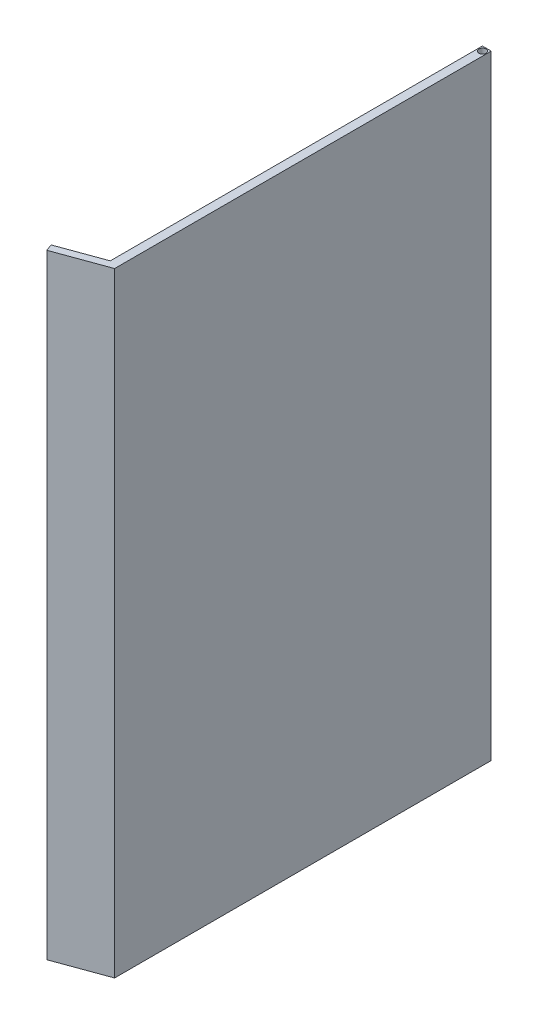
ISO-10303-21;
HEADER;
FILE_DESCRIPTION(('STEP AP214'),'2;1');
FILE_NAME('part.step','',(''),(''),'','','');
FILE_SCHEMA(('AUTOMOTIVE_DESIGN { 1 0 10303 214 1 1 1 1 }'));
ENDSEC;
DATA;
#1=APPLICATION_CONTEXT('core data for automotive mechanical design processes');
#2=APPLICATION_PROTOCOL_DEFINITION('international standard','automotive_design',2000,#1);
#3=PRODUCT_CONTEXT('',#1,'mechanical');
#4=PRODUCT('Part','Part','',(#3));
#5=PRODUCT_RELATED_PRODUCT_CATEGORY('part','',(#4));
#6=PRODUCT_DEFINITION_FORMATION('','',#4);
#7=PRODUCT_DEFINITION_CONTEXT('part definition',#1,'design');
#8=PRODUCT_DEFINITION('design','',#6,#7);
#9=PRODUCT_DEFINITION_SHAPE('','',#8);
#10=(LENGTH_UNIT() NAMED_UNIT(*) SI_UNIT(.MILLI.,.METRE.));
#11=(NAMED_UNIT(*) PLANE_ANGLE_UNIT() SI_UNIT($,.RADIAN.));
#12=(NAMED_UNIT(*) SI_UNIT($,.STERADIAN.) SOLID_ANGLE_UNIT());
#13=UNCERTAINTY_MEASURE_WITH_UNIT(LENGTH_MEASURE(1.E-05),#10,'distance_accuracy_value','');
#14=(GEOMETRIC_REPRESENTATION_CONTEXT(3) GLOBAL_UNCERTAINTY_ASSIGNED_CONTEXT((#13)) GLOBAL_UNIT_ASSIGNED_CONTEXT((#10,
#11,#12)) REPRESENTATION_CONTEXT('',''));
#15=CARTESIAN_POINT('',(0.,0.,0.));
#16=DIRECTION('',(0.,0.,1.));
#17=DIRECTION('',(1.,0.,0.));
#18=AXIS2_PLACEMENT_3D('',#15,#16,#17);
#19=CARTESIAN_POINT('',(1.21931064787366,85.,-16.7659100131921));
#20=DIRECTION('',(0.,0.,1.));
#21=DIRECTION('',(1.,0.,0.));
#22=AXIS2_PLACEMENT_3D('',#19,#20,#21);
#23=PLANE('',#22);
#24=DIRECTION('',(-1.,0.,0.));
#25=VECTOR('',#24,1.);
#26=CARTESIAN_POINT('',(1.21931064787366,0.,-16.7659100131921));
#27=LINE('',#26,#25);
#28=CARTESIAN_POINT('',(1.21931064787366,0.,-16.7659100131921));
#29=VERTEX_POINT('',#28);
#30=CARTESIAN_POINT('',(0.,0.,-16.7659100131921));
#31=VERTEX_POINT('',#30);
#32=EDGE_CURVE('E123',#29,#31,#27,.T.);
#33=ORIENTED_EDGE('',*,*,#32,.T.);
#34=DIRECTION('',(0.,-1.,0.));
#35=VECTOR('',#34,1.);
#36=CARTESIAN_POINT('',(0.,85.,-16.7659100131921));
#37=LINE('',#36,#35);
#38=CARTESIAN_POINT('',(0.,85.,-16.7659100131921));
#39=VERTEX_POINT('',#38);
#40=EDGE_CURVE('E141',#39,#31,#37,.T.);
#41=ORIENTED_EDGE('',*,*,#40,.F.);
#42=DIRECTION('',(-1.,0.,0.));
#43=VECTOR('',#42,1.);
#44=CARTESIAN_POINT('',(1.21931064787366,85.,-16.7659100131921));
#45=LINE('',#44,#43);
#46=CARTESIAN_POINT('',(1.21931064787366,85.,-16.7659100131921));
#47=VERTEX_POINT('',#46);
#48=EDGE_CURVE('E134',#47,#39,#45,.T.);
#49=ORIENTED_EDGE('',*,*,#48,.F.);
#50=DIRECTION('',(0.,-1.,0.));
#51=VECTOR('',#50,1.);
#52=CARTESIAN_POINT('',(1.21931064787366,85.,-16.7659100131921));
#53=LINE('',#52,#51);
#54=EDGE_CURVE('E119',#47,#29,#53,.T.);
#55=ORIENTED_EDGE('',*,*,#54,.T.);
#56=EDGE_LOOP('',(#33,#41,#49,#55));
#57=FACE_BOUND('',#56,.T.);
#58=ADVANCED_FACE('F35',(#57),#23,.F.);
#59=CARTESIAN_POINT('',(0.,85.,-16.7659100131921));
#60=DIRECTION('',(1.,0.,0.));
#61=DIRECTION('',(0.,0.,-1.));
#62=AXIS2_PLACEMENT_3D('',#59,#60,#61);
#63=PLANE('',#62);
#64=DIRECTION('',(0.,0.,1.));
#65=VECTOR('',#64,1.);
#66=CARTESIAN_POINT('',(0.,0.,-16.7659100131921));
#67=LINE('',#66,#65);
#68=CARTESIAN_POINT('',(0.,0.,34.7140899868079));
#69=VERTEX_POINT('',#68);
#70=EDGE_CURVE('E126',#31,#69,#67,.T.);
#71=ORIENTED_EDGE('',*,*,#70,.T.);
#72=DIRECTION('',(0.,-1.,0.));
#73=VECTOR('',#72,1.);
#74=CARTESIAN_POINT('',(0.,85.,34.7140899868079));
#75=LINE('',#74,#73);
#76=CARTESIAN_POINT('',(0.,85.,34.7140899868079));
#77=VERTEX_POINT('',#76);
#78=EDGE_CURVE('E138',#77,#69,#75,.T.);
#79=ORIENTED_EDGE('',*,*,#78,.F.);
#80=DIRECTION('',(0.,0.,1.));
#81=VECTOR('',#80,1.);
#82=CARTESIAN_POINT('',(0.,85.,-16.7659100131921));
#83=LINE('',#82,#81);
#84=EDGE_CURVE('E90',#39,#77,#83,.T.);
#85=ORIENTED_EDGE('',*,*,#84,.F.);
#86=ORIENTED_EDGE('',*,*,#40,.T.);
#87=EDGE_LOOP('',(#71,#79,#85,#86));
#88=FACE_BOUND('',#87,.T.);
#89=ADVANCED_FACE('F171',(#88),#63,.F.);
#90=CARTESIAN_POINT('',(0.,85.,34.7140899868079));
#91=DIRECTION('',(0.342020143325667,0.,0.939692620785909));
#92=DIRECTION('',(0.939692620785909,0.,-0.342020143325667));
#93=AXIS2_PLACEMENT_3D('',#90,#91,#92);
#94=PLANE('',#93);
#95=CARTESIAN_POINT('',(-4.79537646316474,3.79038287197134,36.4594642815006));
#96=DIRECTION('',(0.342020143325667,0.,0.939692620785909));
#97=DIRECTION('',(0.939692620785909,0.,-0.342020143325667));
#98=AXIS2_PLACEMENT_3D('',#95,#96,#97);
#99=CIRCLE('',#98,0.300235792968118);
#100=CARTESIAN_POINT('',(-4.51324710401679,3.79038287197134,36.3567775925581));
#101=VERTEX_POINT('',#100);
#102=EDGE_CURVE('E11',#101,#101,#99,.F.);
#103=ORIENTED_EDGE('',*,*,#102,.F.);
#104=EDGE_LOOP('',(#103));
#105=FACE_BOUND('',#104,.T.);
#106=CARTESIAN_POINT('',(-4.79537646316474,13.7903828719713,36.4594642815006));
#107=DIRECTION('',(0.342020143325667,0.,0.939692620785909));
#108=DIRECTION('',(0.939692620785909,0.,-0.342020143325667));
#109=AXIS2_PLACEMENT_3D('',#106,#107,#108);
#110=CIRCLE('',#109,0.300235792968118);
#111=CARTESIAN_POINT('',(-4.51324710401679,13.7903828719713,36.3567775925581));
#112=VERTEX_POINT('',#111);
#113=EDGE_CURVE('E43',#112,#112,#110,.F.);
#114=ORIENTED_EDGE('',*,*,#113,.F.);
#115=EDGE_LOOP('',(#114));
#116=FACE_BOUND('',#115,.T.);
#117=CARTESIAN_POINT('',(-4.79537646316474,23.7903828719713,36.4594642815006));
#118=DIRECTION('',(0.342020143325667,0.,0.939692620785909));
#119=DIRECTION('',(0.939692620785909,0.,-0.342020143325667));
#120=AXIS2_PLACEMENT_3D('',#117,#118,#119);
#121=CIRCLE('',#120,0.300235792968118);
#122=CARTESIAN_POINT('',(-4.51324710401679,23.7903828719713,36.3567775925581));
#123=VERTEX_POINT('',#122);
#124=EDGE_CURVE('E161',#123,#123,#121,.F.);
#125=ORIENTED_EDGE('',*,*,#124,.F.);
#126=EDGE_LOOP('',(#125));
#127=FACE_BOUND('',#126,.T.);
#128=CARTESIAN_POINT('',(-4.79537646316474,33.7903828719713,36.4594642815006));
#129=DIRECTION('',(0.342020143325667,0.,0.939692620785909));
#130=DIRECTION('',(0.939692620785909,0.,-0.342020143325667));
#131=AXIS2_PLACEMENT_3D('',#128,#129,#130);
#132=CIRCLE('',#131,0.300235792968118);
#133=CARTESIAN_POINT('',(-4.51324710401679,33.7903828719713,36.3567775925581));
#134=VERTEX_POINT('',#133);
#135=EDGE_CURVE('E158',#134,#134,#132,.F.);
#136=ORIENTED_EDGE('',*,*,#135,.F.);
#137=EDGE_LOOP('',(#136));
#138=FACE_BOUND('',#137,.T.);
#139=CARTESIAN_POINT('',(-4.79537646316474,43.7903828719713,36.4594642815006));
#140=DIRECTION('',(0.342020143325667,0.,0.939692620785909));
#141=DIRECTION('',(0.939692620785909,0.,-0.342020143325667));
#142=AXIS2_PLACEMENT_3D('',#139,#140,#141);
#143=CIRCLE('',#142,0.300235792968118);
#144=CARTESIAN_POINT('',(-4.51324710401679,43.7903828719713,36.3567775925581));
#145=VERTEX_POINT('',#144);
#146=EDGE_CURVE('E155',#145,#145,#143,.F.);
#147=ORIENTED_EDGE('',*,*,#146,.F.);
#148=EDGE_LOOP('',(#147));
#149=FACE_BOUND('',#148,.T.);
#150=CARTESIAN_POINT('',(-4.79537646316474,53.7903828719713,36.4594642815006));
#151=DIRECTION('',(0.342020143325667,0.,0.939692620785909));
#152=DIRECTION('',(0.939692620785909,0.,-0.342020143325667));
#153=AXIS2_PLACEMENT_3D('',#150,#151,#152);
#154=CIRCLE('',#153,0.300235792968118);
#155=CARTESIAN_POINT('',(-4.51324710401679,53.7903828719713,36.3567775925581));
#156=VERTEX_POINT('',#155);
#157=EDGE_CURVE('E152',#156,#156,#154,.F.);
#158=ORIENTED_EDGE('',*,*,#157,.F.);
#159=EDGE_LOOP('',(#158));
#160=FACE_BOUND('',#159,.T.);
#161=CARTESIAN_POINT('',(-4.79537646316474,63.7903828719713,36.4594642815006));
#162=DIRECTION('',(0.342020143325667,0.,0.939692620785909));
#163=DIRECTION('',(0.939692620785909,0.,-0.342020143325667));
#164=AXIS2_PLACEMENT_3D('',#161,#162,#163);
#165=CIRCLE('',#164,0.300235792968118);
#166=CARTESIAN_POINT('',(-4.51324710401679,63.7903828719713,36.3567775925581));
#167=VERTEX_POINT('',#166);
#168=EDGE_CURVE('E149',#167,#167,#165,.F.);
#169=ORIENTED_EDGE('',*,*,#168,.F.);
#170=EDGE_LOOP('',(#169));
#171=FACE_BOUND('',#170,.T.);
#172=CARTESIAN_POINT('',(-4.79537646316474,73.7903828719713,36.4594642815006));
#173=DIRECTION('',(0.342020143325667,0.,0.939692620785909));
#174=DIRECTION('',(0.939692620785909,0.,-0.342020143325667));
#175=AXIS2_PLACEMENT_3D('',#172,#173,#174);
#176=CIRCLE('',#175,0.300235792968118);
#177=CARTESIAN_POINT('',(-4.51324710401679,73.7903828719713,36.3567775925581));
#178=VERTEX_POINT('',#177);
#179=EDGE_CURVE('E146',#178,#178,#176,.F.);
#180=ORIENTED_EDGE('',*,*,#179,.F.);
#181=EDGE_LOOP('',(#180));
#182=FACE_BOUND('',#181,.T.);
#183=CARTESIAN_POINT('',(-4.79537646316474,83.7903828719713,36.4594642815006));
#184=DIRECTION('',(0.342020143325667,0.,0.939692620785909));
#185=DIRECTION('',(0.939692620785909,0.,-0.342020143325667));
#186=AXIS2_PLACEMENT_3D('',#183,#184,#185);
#187=CIRCLE('',#186,0.300235792968118);
#188=CARTESIAN_POINT('',(-4.51324710401679,83.7903828719713,36.3567775925581));
#189=VERTEX_POINT('',#188);
#190=EDGE_CURVE('E143',#189,#189,#187,.F.);
#191=ORIENTED_EDGE('',*,*,#190,.F.);
#192=EDGE_LOOP('',(#191));
#193=FACE_BOUND('',#192,.T.);
#194=DIRECTION('',(-0.939692620785909,0.,0.342020143325667));
#195=VECTOR('',#194,1.);
#196=CARTESIAN_POINT('',(0.,0.,34.7140899868079));
#197=LINE('',#196,#195);
#198=CARTESIAN_POINT('',(-5.99999999999999,0.,36.8979113924051));
#199=VERTEX_POINT('',#198);
#200=EDGE_CURVE('E129',#69,#199,#197,.T.);
#201=ORIENTED_EDGE('',*,*,#200,.T.);
#202=DIRECTION('',(0.,-1.,0.));
#203=VECTOR('',#202,1.);
#204=CARTESIAN_POINT('',(-5.99999999999999,85.,36.8979113924051));
#205=LINE('',#204,#203);
#206=CARTESIAN_POINT('',(-5.99999999999999,85.,36.8979113924051));
#207=VERTEX_POINT('',#206);
#208=EDGE_CURVE('E114',#207,#199,#205,.T.);
#209=ORIENTED_EDGE('',*,*,#208,.F.);
#210=DIRECTION('',(-0.939692620785909,0.,0.342020143325667));
#211=VECTOR('',#210,1.);
#212=CARTESIAN_POINT('',(0.,85.,34.7140899868079));
#213=LINE('',#212,#211);
#214=EDGE_CURVE('E105',#77,#207,#213,.T.);
#215=ORIENTED_EDGE('',*,*,#214,.F.);
#216=ORIENTED_EDGE('',*,*,#78,.T.);
#217=EDGE_LOOP('',(#201,#209,#215,#216));
#218=FACE_BOUND('',#217,.T.);
#219=ADVANCED_FACE('F168',(#105,#116,#127,#138,#149,#160,#171,#182,#193,#218),#94,.F.);
#220=CARTESIAN_POINT('',(-5.99999999999999,85.,36.8979113924051));
#221=DIRECTION('',(0.939692620785911,0.,-0.342020143325661));
#222=DIRECTION('',(-0.342020143325661,0.,-0.939692620785911));
#223=AXIS2_PLACEMENT_3D('',#220,#221,#222);
#224=PLANE('',#223);
#225=DIRECTION('',(0.342020143325661,0.,0.939692620785911));
#226=VECTOR('',#225,1.);
#227=CARTESIAN_POINT('',(-5.99999999999999,0.,36.8979113924051));
#228=LINE('',#227,#226);
#229=CARTESIAN_POINT('',(-5.65797985667433,0.,37.837604013191));
#230=VERTEX_POINT('',#229);
#231=EDGE_CURVE('E113',#199,#230,#228,.T.);
#232=ORIENTED_EDGE('',*,*,#231,.T.);
#233=DIRECTION('',(0.,-1.,0.));
#234=VECTOR('',#233,1.);
#235=CARTESIAN_POINT('',(-5.65797985667433,85.,37.837604013191));
#236=LINE('',#235,#234);
#237=CARTESIAN_POINT('',(-5.65797985667433,85.,37.837604013191));
#238=VERTEX_POINT('',#237);
#239=EDGE_CURVE('E110',#238,#230,#236,.T.);
#240=ORIENTED_EDGE('',*,*,#239,.F.);
#241=DIRECTION('',(0.342020143325661,0.,0.939692620785911));
#242=VECTOR('',#241,1.);
#243=CARTESIAN_POINT('',(-5.99999999999999,85.,36.8979113924051));
#244=LINE('',#243,#242);
#245=EDGE_CURVE('E99',#207,#238,#244,.T.);
#246=ORIENTED_EDGE('',*,*,#245,.F.);
#247=ORIENTED_EDGE('',*,*,#208,.T.);
#248=EDGE_LOOP('',(#232,#240,#246,#247));
#249=FACE_BOUND('',#248,.T.);
#250=ADVANCED_FACE('F111',(#249),#224,.F.);
#251=CARTESIAN_POINT('',(-5.65797985667433,85.,37.837604013191));
#252=DIRECTION('',(-0.342020143325666,0.,-0.939692620785909));
#253=DIRECTION('',(-0.939692620785909,0.,0.342020143325666));
#254=AXIS2_PLACEMENT_3D('',#251,#252,#253);
#255=PLANE('',#254);
#256=DIRECTION('',(0.939692620785909,0.,-0.342020143325666));
#257=VECTOR('',#256,1.);
#258=CARTESIAN_POINT('',(-5.65797985667433,0.,37.837604013191));
#259=LINE('',#258,#257);
#260=CARTESIAN_POINT('',(1.21931064787366,0.,35.3344749771339));
#261=VERTEX_POINT('',#260);
#262=EDGE_CURVE('E75',#230,#261,#259,.T.);
#263=ORIENTED_EDGE('',*,*,#262,.T.);
#264=DIRECTION('',(0.,-1.,0.));
#265=VECTOR('',#264,1.);
#266=CARTESIAN_POINT('',(1.21931064787366,85.,35.3344749771339));
#267=LINE('',#266,#265);
#268=CARTESIAN_POINT('',(1.21931064787366,85.,35.3344749771339));
#269=VERTEX_POINT('',#268);
#270=EDGE_CURVE('E115',#269,#261,#267,.T.);
#271=ORIENTED_EDGE('',*,*,#270,.F.);
#272=DIRECTION('',(0.939692620785909,0.,-0.342020143325666));
#273=VECTOR('',#272,1.);
#274=CARTESIAN_POINT('',(-5.65797985667433,85.,37.837604013191));
#275=LINE('',#274,#273);
#276=EDGE_CURVE('E103',#238,#269,#275,.T.);
#277=ORIENTED_EDGE('',*,*,#276,.F.);
#278=ORIENTED_EDGE('',*,*,#239,.T.);
#279=EDGE_LOOP('',(#263,#271,#277,#278));
#280=FACE_BOUND('',#279,.T.);
#281=ADVANCED_FACE('F117',(#280),#255,.F.);
#282=CARTESIAN_POINT('',(1.21931064787366,85.,35.3344749771339));
#283=DIRECTION('',(-1.,0.,0.));
#284=DIRECTION('',(0.,0.,1.));
#285=AXIS2_PLACEMENT_3D('',#282,#283,#284);
#286=PLANE('',#285);
#287=DIRECTION('',(0.,0.,-1.));
#288=VECTOR('',#287,1.);
#289=CARTESIAN_POINT('',(1.21931064787366,0.,35.3344749771339));
#290=LINE('',#289,#288);
#291=EDGE_CURVE('E81',#261,#29,#290,.T.);
#292=ORIENTED_EDGE('',*,*,#291,.T.);
#293=ORIENTED_EDGE('',*,*,#54,.F.);
#294=DIRECTION('',(0.,0.,-1.));
#295=VECTOR('',#294,1.);
#296=CARTESIAN_POINT('',(1.21931064787366,85.,35.3344749771339));
#297=LINE('',#296,#295);
#298=EDGE_CURVE('E51',#269,#47,#297,.T.);
#299=ORIENTED_EDGE('',*,*,#298,.F.);
#300=ORIENTED_EDGE('',*,*,#270,.T.);
#301=EDGE_LOOP('',(#292,#293,#299,#300));
#302=FACE_BOUND('',#301,.T.);
#303=ADVANCED_FACE('F195',(#302),#286,.F.);
#304=CARTESIAN_POINT('',(0.,85.,0.));
#305=DIRECTION('',(0.,1.,0.));
#306=DIRECTION('',(0.,0.,1.));
#307=AXIS2_PLACEMENT_3D('',#304,#305,#306);
#308=PLANE('',#307);
#309=CARTESIAN_POINT('',(0.617040076036639,85.,-16.1614848536612));
#310=DIRECTION('',(0.,1.,0.));
#311=DIRECTION('',(0.,0.,1.));
#312=AXIS2_PLACEMENT_3D('',#309,#310,#311);
#313=CIRCLE('',#312,0.501484150633012);
#314=CARTESIAN_POINT('',(0.617040076036639,85.,-15.6600007030282));
#315=VERTEX_POINT('',#314);
#316=EDGE_CURVE('E468',#315,#315,#313,.T.);
#317=ORIENTED_EDGE('',*,*,#316,.F.);
#318=EDGE_LOOP('',(#317));
#319=FACE_BOUND('',#318,.T.);
#320=ORIENTED_EDGE('',*,*,#48,.T.);
#321=ORIENTED_EDGE('',*,*,#84,.T.);
#322=ORIENTED_EDGE('',*,*,#214,.T.);
#323=ORIENTED_EDGE('',*,*,#245,.T.);
#324=ORIENTED_EDGE('',*,*,#276,.T.);
#325=ORIENTED_EDGE('',*,*,#298,.T.);
#326=EDGE_LOOP('',(#320,#321,#322,#323,#324,#325));
#327=FACE_BOUND('',#326,.T.);
#328=ADVANCED_FACE('F101',(#319,#327),#308,.T.);
#329=CARTESIAN_POINT('',(0.,0.,0.));
#330=DIRECTION('',(0.,1.,0.));
#331=DIRECTION('',(0.,0.,1.));
#332=AXIS2_PLACEMENT_3D('',#329,#330,#331);
#333=PLANE('',#332);
#334=CARTESIAN_POINT('',(0.617040076036639,0.,-16.1614848536612));
#335=DIRECTION('',(0.,1.,0.));
#336=DIRECTION('',(0.,0.,1.));
#337=AXIS2_PLACEMENT_3D('',#334,#335,#336);
#338=CIRCLE('',#337,0.501484150633012);
#339=CARTESIAN_POINT('',(0.617040076036639,0.,-15.6600007030282));
#340=VERTEX_POINT('',#339);
#341=EDGE_CURVE('E127',#340,#340,#338,.T.);
#342=ORIENTED_EDGE('',*,*,#341,.T.);
#343=EDGE_LOOP('',(#342));
#344=FACE_BOUND('',#343,.T.);
#345=ORIENTED_EDGE('',*,*,#32,.F.);
#346=ORIENTED_EDGE('',*,*,#291,.F.);
#347=ORIENTED_EDGE('',*,*,#262,.F.);
#348=ORIENTED_EDGE('',*,*,#231,.F.);
#349=ORIENTED_EDGE('',*,*,#200,.F.);
#350=ORIENTED_EDGE('',*,*,#70,.F.);
#351=EDGE_LOOP('',(#345,#346,#347,#348,#349,#350));
#352=FACE_BOUND('',#351,.T.);
#353=ADVANCED_FACE('F191',(#344,#352),#333,.F.);
#354=CARTESIAN_POINT('',(0.617040076036639,0.,-16.1614848536612));
#355=DIRECTION('',(0.,1.,0.));
#356=DIRECTION('',(0.,0.,1.));
#357=AXIS2_PLACEMENT_3D('',#354,#355,#356);
#358=CYLINDRICAL_SURFACE('',#357,0.501484150633012);
#359=ORIENTED_EDGE('',*,*,#341,.F.);
#360=EDGE_LOOP('',(#359));
#361=FACE_BOUND('',#360,.T.);
#362=ORIENTED_EDGE('',*,*,#316,.T.);
#363=EDGE_LOOP('',(#362));
#364=FACE_BOUND('',#363,.T.);
#365=ADVANCED_FACE('F241',(#361,#364),#358,.F.);
#366=CARTESIAN_POINT('',(-4.96638653482757,83.7903828719713,35.9896179711076));
#367=DIRECTION('',(0.342020143325667,0.,0.939692620785909));
#368=DIRECTION('',(0.939692620785909,0.,-0.342020143325667));
#369=AXIS2_PLACEMENT_3D('',#366,#367,#368);
#370=CYLINDRICAL_SURFACE('',#369,0.300235792968118);
#371=CARTESIAN_POINT('',(-4.96638653482757,83.7903828719713,35.9896179711076));
#372=DIRECTION('',(-0.342020143325667,0.,-0.939692620785909));
#373=DIRECTION('',(-0.939692620785909,0.,0.342020143325667));
#374=AXIS2_PLACEMENT_3D('',#371,#372,#373);
#375=CIRCLE('',#374,0.300235792968118);
#376=CARTESIAN_POINT('',(-5.24851589397552,83.7903828719713,36.0923046600501));
#377=VERTEX_POINT('',#376);
#378=EDGE_CURVE('E465',#377,#377,#375,.T.);
#379=ORIENTED_EDGE('',*,*,#378,.F.);
#380=EDGE_LOOP('',(#379));
#381=FACE_BOUND('',#380,.T.);
#382=ORIENTED_EDGE('',*,*,#190,.T.);
#383=EDGE_LOOP('',(#382));
#384=FACE_BOUND('',#383,.T.);
#385=ADVANCED_FACE('F250',(#381,#384),#370,.T.);
#386=CARTESIAN_POINT('',(-4.96638653482757,83.7903828719713,35.9896179711076));
#387=DIRECTION('',(0.342020143325668,0.,0.939692620785909));
#388=DIRECTION('',(0.939692620785909,0.,-0.342020143325668));
#389=AXIS2_PLACEMENT_3D('',#386,#387,#388);
#390=CONICAL_SURFACE('',#389,0.300235792968121,0.489837368305722);
#391=CARTESIAN_POINT('',(-5.15897971295902,83.7903828719713,35.4604725630505));
#392=VERTEX_POINT('',#391);
#393=VERTEX_LOOP('',#392);
#394=FACE_BOUND('',#393,.T.);
#395=ORIENTED_EDGE('',*,*,#378,.T.);
#396=EDGE_LOOP('',(#395));
#397=FACE_BOUND('',#396,.T.);
#398=ADVANCED_FACE('F260',(#394,#397),#390,.T.);
#399=CARTESIAN_POINT('',(-4.96638653482757,73.7903828719713,35.9896179711076));
#400=DIRECTION('',(0.342020143325667,0.,0.939692620785909));
#401=DIRECTION('',(0.939692620785909,0.,-0.342020143325667));
#402=AXIS2_PLACEMENT_3D('',#399,#400,#401);
#403=CYLINDRICAL_SURFACE('',#402,0.300235792968118);
#404=CARTESIAN_POINT('',(-4.96638653482757,73.7903828719713,35.9896179711076));
#405=DIRECTION('',(-0.342020143325667,0.,-0.939692620785909));
#406=DIRECTION('',(-0.939692620785909,0.,0.342020143325667));
#407=AXIS2_PLACEMENT_3D('',#404,#405,#406);
#408=CIRCLE('',#407,0.300235792968118);
#409=CARTESIAN_POINT('',(-5.24851589397552,73.7903828719713,36.0923046600501));
#410=VERTEX_POINT('',#409);
#411=EDGE_CURVE('E462',#410,#410,#408,.T.);
#412=ORIENTED_EDGE('',*,*,#411,.F.);
#413=EDGE_LOOP('',(#412));
#414=FACE_BOUND('',#413,.T.);
#415=ORIENTED_EDGE('',*,*,#179,.T.);
#416=EDGE_LOOP('',(#415));
#417=FACE_BOUND('',#416,.T.);
#418=ADVANCED_FACE('F269',(#414,#417),#403,.T.);
#419=CARTESIAN_POINT('',(-4.96638653482757,63.7903828719713,35.9896179711076));
#420=DIRECTION('',(0.342020143325667,0.,0.939692620785909));
#421=DIRECTION('',(0.939692620785909,0.,-0.342020143325667));
#422=AXIS2_PLACEMENT_3D('',#419,#420,#421);
#423=CYLINDRICAL_SURFACE('',#422,0.300235792968118);
#424=CARTESIAN_POINT('',(-4.96638653482757,63.7903828719713,35.9896179711076));
#425=DIRECTION('',(-0.342020143325667,0.,-0.939692620785909));
#426=DIRECTION('',(-0.939692620785909,0.,0.342020143325667));
#427=AXIS2_PLACEMENT_3D('',#424,#425,#426);
#428=CIRCLE('',#427,0.300235792968118);
#429=CARTESIAN_POINT('',(-5.24851589397552,63.7903828719713,36.0923046600501));
#430=VERTEX_POINT('',#429);
#431=EDGE_CURVE('E459',#430,#430,#428,.T.);
#432=ORIENTED_EDGE('',*,*,#431,.F.);
#433=EDGE_LOOP('',(#432));
#434=FACE_BOUND('',#433,.T.);
#435=ORIENTED_EDGE('',*,*,#168,.T.);
#436=EDGE_LOOP('',(#435));
#437=FACE_BOUND('',#436,.T.);
#438=ADVANCED_FACE('F283',(#434,#437),#423,.T.);
#439=CARTESIAN_POINT('',(-4.96638653482757,53.7903828719713,35.9896179711076));
#440=DIRECTION('',(0.342020143325667,0.,0.939692620785909));
#441=DIRECTION('',(0.939692620785909,0.,-0.342020143325667));
#442=AXIS2_PLACEMENT_3D('',#439,#440,#441);
#443=CYLINDRICAL_SURFACE('',#442,0.300235792968118);
#444=CARTESIAN_POINT('',(-4.96638653482757,53.7903828719713,35.9896179711076));
#445=DIRECTION('',(-0.342020143325667,0.,-0.939692620785909));
#446=DIRECTION('',(-0.939692620785909,0.,0.342020143325667));
#447=AXIS2_PLACEMENT_3D('',#444,#445,#446);
#448=CIRCLE('',#447,0.300235792968118);
#449=CARTESIAN_POINT('',(-5.24851589397552,53.7903828719713,36.0923046600501));
#450=VERTEX_POINT('',#449);
#451=EDGE_CURVE('E456',#450,#450,#448,.T.);
#452=ORIENTED_EDGE('',*,*,#451,.F.);
#453=EDGE_LOOP('',(#452));
#454=FACE_BOUND('',#453,.T.);
#455=ORIENTED_EDGE('',*,*,#157,.T.);
#456=EDGE_LOOP('',(#455));
#457=FACE_BOUND('',#456,.T.);
#458=ADVANCED_FACE('F293',(#454,#457),#443,.T.);
#459=CARTESIAN_POINT('',(-4.96638653482757,43.7903828719713,35.9896179711076));
#460=DIRECTION('',(0.342020143325667,0.,0.939692620785909));
#461=DIRECTION('',(0.939692620785909,0.,-0.342020143325667));
#462=AXIS2_PLACEMENT_3D('',#459,#460,#461);
#463=CYLINDRICAL_SURFACE('',#462,0.300235792968118);
#464=CARTESIAN_POINT('',(-4.96638653482757,43.7903828719713,35.9896179711076));
#465=DIRECTION('',(-0.342020143325667,0.,-0.939692620785909));
#466=DIRECTION('',(-0.939692620785909,0.,0.342020143325667));
#467=AXIS2_PLACEMENT_3D('',#464,#465,#466);
#468=CIRCLE('',#467,0.300235792968118);
#469=CARTESIAN_POINT('',(-5.24851589397552,43.7903828719713,36.0923046600501));
#470=VERTEX_POINT('',#469);
#471=EDGE_CURVE('E453',#470,#470,#468,.T.);
#472=ORIENTED_EDGE('',*,*,#471,.F.);
#473=EDGE_LOOP('',(#472));
#474=FACE_BOUND('',#473,.T.);
#475=ORIENTED_EDGE('',*,*,#146,.T.);
#476=EDGE_LOOP('',(#475));
#477=FACE_BOUND('',#476,.T.);
#478=ADVANCED_FACE('F303',(#474,#477),#463,.T.);
#479=CARTESIAN_POINT('',(-4.96638653482757,33.7903828719713,35.9896179711076));
#480=DIRECTION('',(0.342020143325667,0.,0.939692620785909));
#481=DIRECTION('',(0.939692620785909,0.,-0.342020143325667));
#482=AXIS2_PLACEMENT_3D('',#479,#480,#481);
#483=CYLINDRICAL_SURFACE('',#482,0.300235792968118);
#484=CARTESIAN_POINT('',(-4.96638653482757,33.7903828719713,35.9896179711076));
#485=DIRECTION('',(-0.342020143325667,0.,-0.939692620785909));
#486=DIRECTION('',(-0.939692620785909,0.,0.342020143325667));
#487=AXIS2_PLACEMENT_3D('',#484,#485,#486);
#488=CIRCLE('',#487,0.300235792968118);
#489=CARTESIAN_POINT('',(-5.24851589397552,33.7903828719713,36.0923046600501));
#490=VERTEX_POINT('',#489);
#491=EDGE_CURVE('E450',#490,#490,#488,.T.);
#492=ORIENTED_EDGE('',*,*,#491,.F.);
#493=EDGE_LOOP('',(#492));
#494=FACE_BOUND('',#493,.T.);
#495=ORIENTED_EDGE('',*,*,#135,.T.);
#496=EDGE_LOOP('',(#495));
#497=FACE_BOUND('',#496,.T.);
#498=ADVANCED_FACE('F313',(#494,#497),#483,.T.);
#499=CARTESIAN_POINT('',(-4.96638653482757,23.7903828719713,35.9896179711076));
#500=DIRECTION('',(0.342020143325667,0.,0.939692620785909));
#501=DIRECTION('',(0.939692620785909,0.,-0.342020143325667));
#502=AXIS2_PLACEMENT_3D('',#499,#500,#501);
#503=CYLINDRICAL_SURFACE('',#502,0.300235792968118);
#504=CARTESIAN_POINT('',(-4.96638653482757,23.7903828719713,35.9896179711076));
#505=DIRECTION('',(-0.342020143325667,0.,-0.939692620785909));
#506=DIRECTION('',(-0.939692620785909,0.,0.342020143325667));
#507=AXIS2_PLACEMENT_3D('',#504,#505,#506);
#508=CIRCLE('',#507,0.300235792968118);
#509=CARTESIAN_POINT('',(-5.24851589397552,23.7903828719713,36.0923046600501));
#510=VERTEX_POINT('',#509);
#511=EDGE_CURVE('E445',#510,#510,#508,.T.);
#512=ORIENTED_EDGE('',*,*,#511,.F.);
#513=EDGE_LOOP('',(#512));
#514=FACE_BOUND('',#513,.T.);
#515=ORIENTED_EDGE('',*,*,#124,.T.);
#516=EDGE_LOOP('',(#515));
#517=FACE_BOUND('',#516,.T.);
#518=ADVANCED_FACE('F323',(#514,#517),#503,.T.);
#519=CARTESIAN_POINT('',(-4.96638653482757,13.7903828719713,35.9896179711076));
#520=DIRECTION('',(0.342020143325667,0.,0.939692620785909));
#521=DIRECTION('',(0.939692620785909,0.,-0.342020143325667));
#522=AXIS2_PLACEMENT_3D('',#519,#520,#521);
#523=CYLINDRICAL_SURFACE('',#522,0.300235792968118);
#524=CARTESIAN_POINT('',(-4.96638653482757,13.7903828719713,35.9896179711076));
#525=DIRECTION('',(-0.342020143325667,0.,-0.939692620785909));
#526=DIRECTION('',(-0.939692620785909,0.,0.342020143325667));
#527=AXIS2_PLACEMENT_3D('',#524,#525,#526);
#528=CIRCLE('',#527,0.300235792968118);
#529=CARTESIAN_POINT('',(-5.24851589397552,13.7903828719713,36.0923046600501));
#530=VERTEX_POINT('',#529);
#531=EDGE_CURVE('E442',#530,#530,#528,.T.);
#532=ORIENTED_EDGE('',*,*,#531,.F.);
#533=EDGE_LOOP('',(#532));
#534=FACE_BOUND('',#533,.T.);
#535=ORIENTED_EDGE('',*,*,#113,.T.);
#536=EDGE_LOOP('',(#535));
#537=FACE_BOUND('',#536,.T.);
#538=ADVANCED_FACE('F166',(#534,#537),#523,.T.);
#539=CARTESIAN_POINT('',(-4.96638653482757,3.79038287197134,35.9896179711076));
#540=DIRECTION('',(0.342020143325667,0.,0.939692620785909));
#541=DIRECTION('',(0.939692620785909,0.,-0.342020143325667));
#542=AXIS2_PLACEMENT_3D('',#539,#540,#541);
#543=CYLINDRICAL_SURFACE('',#542,0.300235792968118);
#544=CARTESIAN_POINT('',(-4.96638653482757,3.79038287197134,35.9896179711076));
#545=DIRECTION('',(-0.342020143325667,0.,-0.939692620785909));
#546=DIRECTION('',(-0.939692620785909,0.,0.342020143325667));
#547=AXIS2_PLACEMENT_3D('',#544,#545,#546);
#548=CIRCLE('',#547,0.300235792968118);
#549=CARTESIAN_POINT('',(-5.24851589397552,3.79038287197134,36.0923046600501));
#550=VERTEX_POINT('',#549);
#551=EDGE_CURVE('E441',#550,#550,#548,.T.);
#552=ORIENTED_EDGE('',*,*,#551,.F.);
#553=EDGE_LOOP('',(#552));
#554=FACE_BOUND('',#553,.T.);
#555=ORIENTED_EDGE('',*,*,#102,.T.);
#556=EDGE_LOOP('',(#555));
#557=FACE_BOUND('',#556,.T.);
#558=ADVANCED_FACE('F342',(#554,#557),#543,.T.);
#559=CARTESIAN_POINT('',(-4.96638653482757,73.7903828719713,35.9896179711076));
#560=DIRECTION('',(0.342020143325668,0.,0.939692620785909));
#561=DIRECTION('',(0.939692620785909,0.,-0.342020143325668));
#562=AXIS2_PLACEMENT_3D('',#559,#560,#561);
#563=CONICAL_SURFACE('',#562,0.300235792968121,0.489837368305722);
#564=CARTESIAN_POINT('',(-5.15897971295902,73.7903828719713,35.4604725630505));
#565=VERTEX_POINT('',#564);
#566=VERTEX_LOOP('',#565);
#567=FACE_BOUND('',#566,.T.);
#568=ORIENTED_EDGE('',*,*,#411,.T.);
#569=EDGE_LOOP('',(#568));
#570=FACE_BOUND('',#569,.T.);
#571=ADVANCED_FACE('F352',(#567,#570),#563,.T.);
#572=CARTESIAN_POINT('',(-4.96638653482757,63.7903828719713,35.9896179711076));
#573=DIRECTION('',(0.342020143325668,0.,0.939692620785909));
#574=DIRECTION('',(0.939692620785909,0.,-0.342020143325668));
#575=AXIS2_PLACEMENT_3D('',#572,#573,#574);
#576=CONICAL_SURFACE('',#575,0.300235792968121,0.489837368305722);
#577=CARTESIAN_POINT('',(-5.15897971295902,63.7903828719713,35.4604725630505));
#578=VERTEX_POINT('',#577);
#579=VERTEX_LOOP('',#578);
#580=FACE_BOUND('',#579,.T.);
#581=ORIENTED_EDGE('',*,*,#431,.T.);
#582=EDGE_LOOP('',(#581));
#583=FACE_BOUND('',#582,.T.);
#584=ADVANCED_FACE('F362',(#580,#583),#576,.T.);
#585=CARTESIAN_POINT('',(-4.96638653482757,53.7903828719713,35.9896179711076));
#586=DIRECTION('',(0.342020143325668,0.,0.939692620785909));
#587=DIRECTION('',(0.939692620785909,0.,-0.342020143325668));
#588=AXIS2_PLACEMENT_3D('',#585,#586,#587);
#589=CONICAL_SURFACE('',#588,0.300235792968121,0.489837368305722);
#590=CARTESIAN_POINT('',(-5.15897971295902,53.7903828719713,35.4604725630505));
#591=VERTEX_POINT('',#590);
#592=VERTEX_LOOP('',#591);
#593=FACE_BOUND('',#592,.T.);
#594=ORIENTED_EDGE('',*,*,#451,.T.);
#595=EDGE_LOOP('',(#594));
#596=FACE_BOUND('',#595,.T.);
#597=ADVANCED_FACE('F372',(#593,#596),#589,.T.);
#598=CARTESIAN_POINT('',(-4.96638653482757,43.7903828719713,35.9896179711076));
#599=DIRECTION('',(0.342020143325668,0.,0.939692620785909));
#600=DIRECTION('',(0.939692620785909,0.,-0.342020143325668));
#601=AXIS2_PLACEMENT_3D('',#598,#599,#600);
#602=CONICAL_SURFACE('',#601,0.300235792968121,0.489837368305722);
#603=CARTESIAN_POINT('',(-5.15897971295902,43.7903828719713,35.4604725630505));
#604=VERTEX_POINT('',#603);
#605=VERTEX_LOOP('',#604);
#606=FACE_BOUND('',#605,.T.);
#607=ORIENTED_EDGE('',*,*,#471,.T.);
#608=EDGE_LOOP('',(#607));
#609=FACE_BOUND('',#608,.T.);
#610=ADVANCED_FACE('F382',(#606,#609),#602,.T.);
#611=CARTESIAN_POINT('',(-4.96638653482757,33.7903828719713,35.9896179711076));
#612=DIRECTION('',(0.342020143325668,0.,0.939692620785909));
#613=DIRECTION('',(0.939692620785909,0.,-0.342020143325668));
#614=AXIS2_PLACEMENT_3D('',#611,#612,#613);
#615=CONICAL_SURFACE('',#614,0.300235792968121,0.489837368305722);
#616=CARTESIAN_POINT('',(-5.15897971295902,33.7903828719713,35.4604725630505));
#617=VERTEX_POINT('',#616);
#618=VERTEX_LOOP('',#617);
#619=FACE_BOUND('',#618,.T.);
#620=ORIENTED_EDGE('',*,*,#491,.T.);
#621=EDGE_LOOP('',(#620));
#622=FACE_BOUND('',#621,.T.);
#623=ADVANCED_FACE('F392',(#619,#622),#615,.T.);
#624=CARTESIAN_POINT('',(-4.96638653482757,23.7903828719713,35.9896179711076));
#625=DIRECTION('',(0.342020143325668,0.,0.939692620785909));
#626=DIRECTION('',(0.939692620785909,0.,-0.342020143325668));
#627=AXIS2_PLACEMENT_3D('',#624,#625,#626);
#628=CONICAL_SURFACE('',#627,0.300235792968121,0.489837368305722);
#629=CARTESIAN_POINT('',(-5.15897971295902,23.7903828719713,35.4604725630505));
#630=VERTEX_POINT('',#629);
#631=VERTEX_LOOP('',#630);
#632=FACE_BOUND('',#631,.T.);
#633=ORIENTED_EDGE('',*,*,#511,.T.);
#634=EDGE_LOOP('',(#633));
#635=FACE_BOUND('',#634,.T.);
#636=ADVANCED_FACE('F402',(#632,#635),#628,.T.);
#637=CARTESIAN_POINT('',(-4.96638653482757,13.7903828719713,35.9896179711076));
#638=DIRECTION('',(0.342020143325668,0.,0.939692620785909));
#639=DIRECTION('',(0.939692620785909,0.,-0.342020143325668));
#640=AXIS2_PLACEMENT_3D('',#637,#638,#639);
#641=CONICAL_SURFACE('',#640,0.300235792968121,0.489837368305722);
#642=CARTESIAN_POINT('',(-5.15897971295902,13.7903828719713,35.4604725630505));
#643=VERTEX_POINT('',#642);
#644=VERTEX_LOOP('',#643);
#645=FACE_BOUND('',#644,.T.);
#646=ORIENTED_EDGE('',*,*,#531,.T.);
#647=EDGE_LOOP('',(#646));
#648=FACE_BOUND('',#647,.T.);
#649=ADVANCED_FACE('F412',(#645,#648),#641,.T.);
#650=CARTESIAN_POINT('',(-4.96638653482757,3.79038287197135,35.9896179711076));
#651=DIRECTION('',(0.342020143325668,0.,0.939692620785909));
#652=DIRECTION('',(0.939692620785909,0.,-0.342020143325668));
#653=AXIS2_PLACEMENT_3D('',#650,#651,#652);
#654=CONICAL_SURFACE('',#653,0.300235792968121,0.489837368305722);
#655=CARTESIAN_POINT('',(-5.15897971295902,3.79038287197135,35.4604725630505));
#656=VERTEX_POINT('',#655);
#657=VERTEX_LOOP('',#656);
#658=FACE_BOUND('',#657,.T.);
#659=ORIENTED_EDGE('',*,*,#551,.T.);
#660=EDGE_LOOP('',(#659));
#661=FACE_BOUND('',#660,.T.);
#662=ADVANCED_FACE('F422',(#658,#661),#654,.T.);
#663=CLOSED_SHELL('',(#58,#89,#219,#250,#281,#303,#328,#353,#365,#385,#398,#418,#438,#458,#478,
#498,#518,#538,#558,#571,#584,#597,#610,#623,#636,#649,#662));
#664=MANIFOLD_SOLID_BREP('B2',#663);
#665=ADVANCED_BREP_SHAPE_REPRESENTATION('',(#18,#664),#14);
#666=SHAPE_DEFINITION_REPRESENTATION(#9,#665);
ENDSEC;
END-ISO-10303-21;
